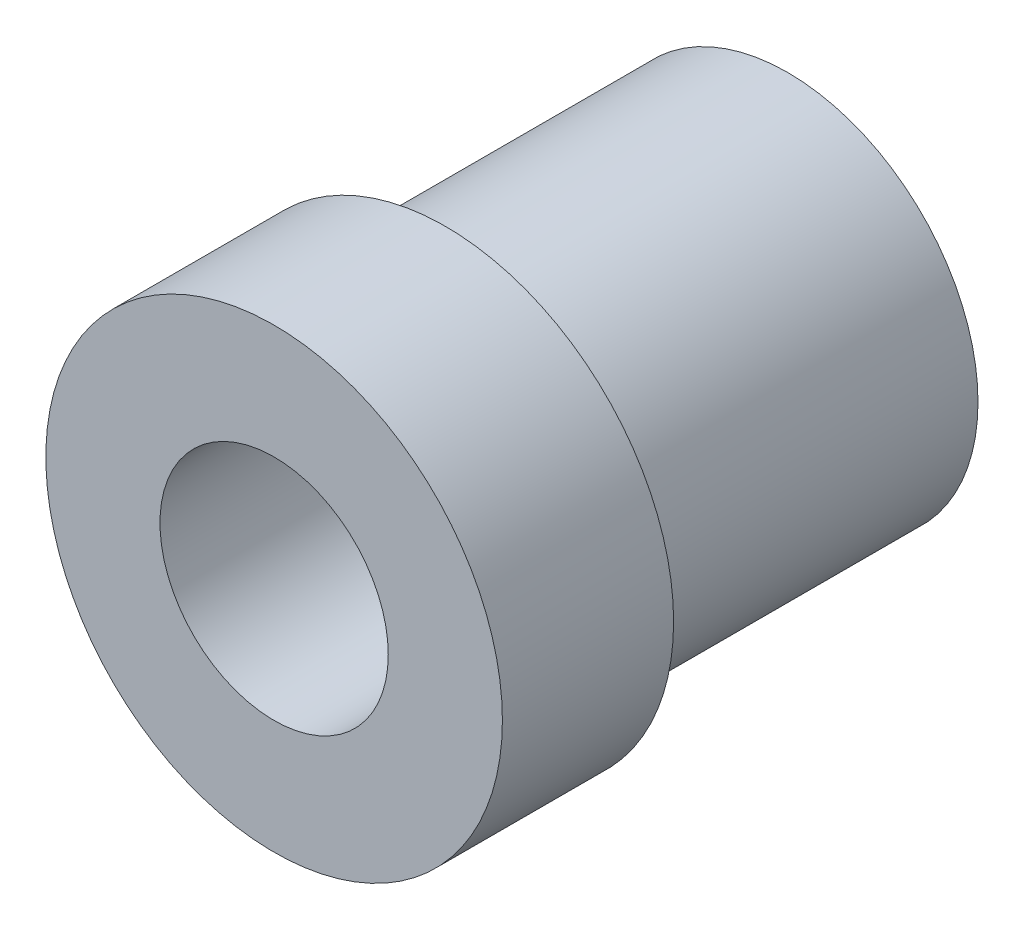
ISO-10303-21;
HEADER;
FILE_DESCRIPTION(('STEP AP214'),'2;1');
FILE_NAME('part.step','',(''),(''),'','','');
FILE_SCHEMA(('AUTOMOTIVE_DESIGN { 1 0 10303 214 1 1 1 1 }'));
ENDSEC;
DATA;
#1=APPLICATION_CONTEXT('core data for automotive mechanical design processes');
#2=APPLICATION_PROTOCOL_DEFINITION('international standard','automotive_design',2000,#1);
#3=PRODUCT_CONTEXT('',#1,'mechanical');
#4=PRODUCT('Part','Part','',(#3));
#5=PRODUCT_RELATED_PRODUCT_CATEGORY('part','',(#4));
#6=PRODUCT_DEFINITION_FORMATION('','',#4);
#7=PRODUCT_DEFINITION_CONTEXT('part definition',#1,'design');
#8=PRODUCT_DEFINITION('design','',#6,#7);
#9=PRODUCT_DEFINITION_SHAPE('','',#8);
#10=(LENGTH_UNIT() NAMED_UNIT(*) SI_UNIT(.MILLI.,.METRE.));
#11=(NAMED_UNIT(*) PLANE_ANGLE_UNIT() SI_UNIT($,.RADIAN.));
#12=(NAMED_UNIT(*) SI_UNIT($,.STERADIAN.) SOLID_ANGLE_UNIT());
#13=UNCERTAINTY_MEASURE_WITH_UNIT(LENGTH_MEASURE(1.E-05),#10,'distance_accuracy_value','');
#14=(GEOMETRIC_REPRESENTATION_CONTEXT(3) GLOBAL_UNCERTAINTY_ASSIGNED_CONTEXT((#13)) GLOBAL_UNIT_ASSIGNED_CONTEXT((#10,
#11,#12)) REPRESENTATION_CONTEXT('',''));
#15=CARTESIAN_POINT('',(0.,0.,0.));
#16=DIRECTION('',(0.,0.,1.));
#17=DIRECTION('',(1.,0.,0.));
#18=AXIS2_PLACEMENT_3D('',#15,#16,#17);
#19=CARTESIAN_POINT('',(0.,0.,9.));
#20=DIRECTION('',(0.,0.,-1.));
#21=DIRECTION('',(-1.,0.,0.));
#22=AXIS2_PLACEMENT_3D('',#19,#20,#21);
#23=CYLINDRICAL_SURFACE('',#22,5.);
#24=CARTESIAN_POINT('',(0.,0.,9.));
#25=DIRECTION('',(0.,0.,1.));
#26=DIRECTION('',(1.,0.,0.));
#27=AXIS2_PLACEMENT_3D('',#24,#25,#26);
#28=CIRCLE('',#27,5.);
#29=CARTESIAN_POINT('',(5.,0.,9.));
#30=VERTEX_POINT('',#29);
#31=EDGE_CURVE('E10',#30,#30,#28,.T.);
#32=ORIENTED_EDGE('',*,*,#31,.F.);
#33=EDGE_LOOP('',(#32));
#34=FACE_BOUND('',#33,.T.);
#35=CARTESIAN_POINT('',(0.,0.,0.));
#36=DIRECTION('',(0.,0.,1.));
#37=DIRECTION('',(1.,0.,0.));
#38=AXIS2_PLACEMENT_3D('',#35,#36,#37);
#39=CIRCLE('',#38,5.);
#40=CARTESIAN_POINT('',(5.,0.,0.));
#41=VERTEX_POINT('',#40);
#42=EDGE_CURVE('E40',#41,#41,#39,.T.);
#43=ORIENTED_EDGE('',*,*,#42,.T.);
#44=EDGE_LOOP('',(#43));
#45=FACE_BOUND('',#44,.T.);
#46=ADVANCED_FACE('F37',(#34,#45),#23,.T.);
#47=CARTESIAN_POINT('',(0.,0.,0.));
#48=DIRECTION('',(0.,0.,1.));
#49=DIRECTION('',(1.,0.,0.));
#50=AXIS2_PLACEMENT_3D('',#47,#48,#49);
#51=PLANE('',#50);
#52=CARTESIAN_POINT('',(0.,0.,0.));
#53=DIRECTION('',(0.,0.,1.));
#54=DIRECTION('',(1.,0.,0.));
#55=AXIS2_PLACEMENT_3D('',#52,#53,#54);
#56=CIRCLE('',#55,3.);
#57=CARTESIAN_POINT('',(3.,0.,0.));
#58=VERTEX_POINT('',#57);
#59=EDGE_CURVE('E52',#58,#58,#56,.T.);
#60=ORIENTED_EDGE('',*,*,#59,.T.);
#61=EDGE_LOOP('',(#60));
#62=FACE_BOUND('',#61,.T.);
#63=ORIENTED_EDGE('',*,*,#42,.F.);
#64=EDGE_LOOP('',(#63));
#65=FACE_BOUND('',#64,.T.);
#66=ADVANCED_FACE('F61',(#62,#65),#51,.F.);
#67=CARTESIAN_POINT('',(0.,0.,13.5));
#68=DIRECTION('',(0.,0.,-1.));
#69=DIRECTION('',(-1.,0.,0.));
#70=AXIS2_PLACEMENT_3D('',#67,#68,#69);
#71=CYLINDRICAL_SURFACE('',#70,6.);
#72=CARTESIAN_POINT('',(0.,0.,13.5));
#73=DIRECTION('',(0.,0.,1.));
#74=DIRECTION('',(1.,0.,0.));
#75=AXIS2_PLACEMENT_3D('',#72,#73,#74);
#76=CIRCLE('',#75,6.);
#77=CARTESIAN_POINT('',(6.,0.,13.5));
#78=VERTEX_POINT('',#77);
#79=EDGE_CURVE('E47',#78,#78,#76,.T.);
#80=ORIENTED_EDGE('',*,*,#79,.F.);
#81=EDGE_LOOP('',(#80));
#82=FACE_BOUND('',#81,.T.);
#83=CARTESIAN_POINT('',(0.,0.,9.));
#84=DIRECTION('',(0.,0.,1.));
#85=DIRECTION('',(1.,0.,0.));
#86=AXIS2_PLACEMENT_3D('',#83,#84,#85);
#87=CIRCLE('',#86,6.);
#88=CARTESIAN_POINT('',(6.,0.,9.));
#89=VERTEX_POINT('',#88);
#90=EDGE_CURVE('E49',#89,#89,#87,.T.);
#91=ORIENTED_EDGE('',*,*,#90,.T.);
#92=EDGE_LOOP('',(#91));
#93=FACE_BOUND('',#92,.T.);
#94=ADVANCED_FACE('F74',(#82,#93),#71,.T.);
#95=CARTESIAN_POINT('',(0.,0.,13.5));
#96=DIRECTION('',(0.,0.,1.));
#97=DIRECTION('',(1.,0.,0.));
#98=AXIS2_PLACEMENT_3D('',#95,#96,#97);
#99=PLANE('',#98);
#100=CARTESIAN_POINT('',(0.,0.,13.5));
#101=DIRECTION('',(0.,0.,1.));
#102=DIRECTION('',(1.,0.,0.));
#103=AXIS2_PLACEMENT_3D('',#100,#101,#102);
#104=CIRCLE('',#103,3.);
#105=CARTESIAN_POINT('',(3.,0.,13.5));
#106=VERTEX_POINT('',#105);
#107=EDGE_CURVE('E55',#106,#106,#104,.T.);
#108=ORIENTED_EDGE('',*,*,#107,.F.);
#109=EDGE_LOOP('',(#108));
#110=FACE_BOUND('',#109,.T.);
#111=ORIENTED_EDGE('',*,*,#79,.T.);
#112=EDGE_LOOP('',(#111));
#113=FACE_BOUND('',#112,.T.);
#114=ADVANCED_FACE('F71',(#110,#113),#99,.T.);
#115=CARTESIAN_POINT('',(0.,0.,9.));
#116=DIRECTION('',(0.,0.,1.));
#117=DIRECTION('',(1.,0.,0.));
#118=AXIS2_PLACEMENT_3D('',#115,#116,#117);
#119=PLANE('',#118);
#120=ORIENTED_EDGE('',*,*,#31,.T.);
#121=EDGE_LOOP('',(#120));
#122=FACE_BOUND('',#121,.T.);
#123=ORIENTED_EDGE('',*,*,#90,.F.);
#124=EDGE_LOOP('',(#123));
#125=FACE_BOUND('',#124,.T.);
#126=ADVANCED_FACE('F67',(#122,#125),#119,.F.);
#127=CARTESIAN_POINT('',(0.,0.,0.));
#128=DIRECTION('',(0.,0.,1.));
#129=DIRECTION('',(1.,0.,0.));
#130=AXIS2_PLACEMENT_3D('',#127,#128,#129);
#131=CYLINDRICAL_SURFACE('',#130,3.);
#132=ORIENTED_EDGE('',*,*,#59,.F.);
#133=EDGE_LOOP('',(#132));
#134=FACE_BOUND('',#133,.T.);
#135=ORIENTED_EDGE('',*,*,#107,.T.);
#136=EDGE_LOOP('',(#135));
#137=FACE_BOUND('',#136,.T.);
#138=ADVANCED_FACE('F64',(#134,#137),#131,.F.);
#139=CLOSED_SHELL('',(#46,#66,#94,#114,#126,#138));
#140=MANIFOLD_SOLID_BREP('B2',#139);
#141=ADVANCED_BREP_SHAPE_REPRESENTATION('',(#18,#140),#14);
#142=SHAPE_DEFINITION_REPRESENTATION(#9,#141);
ENDSEC;
END-ISO-10303-21;
